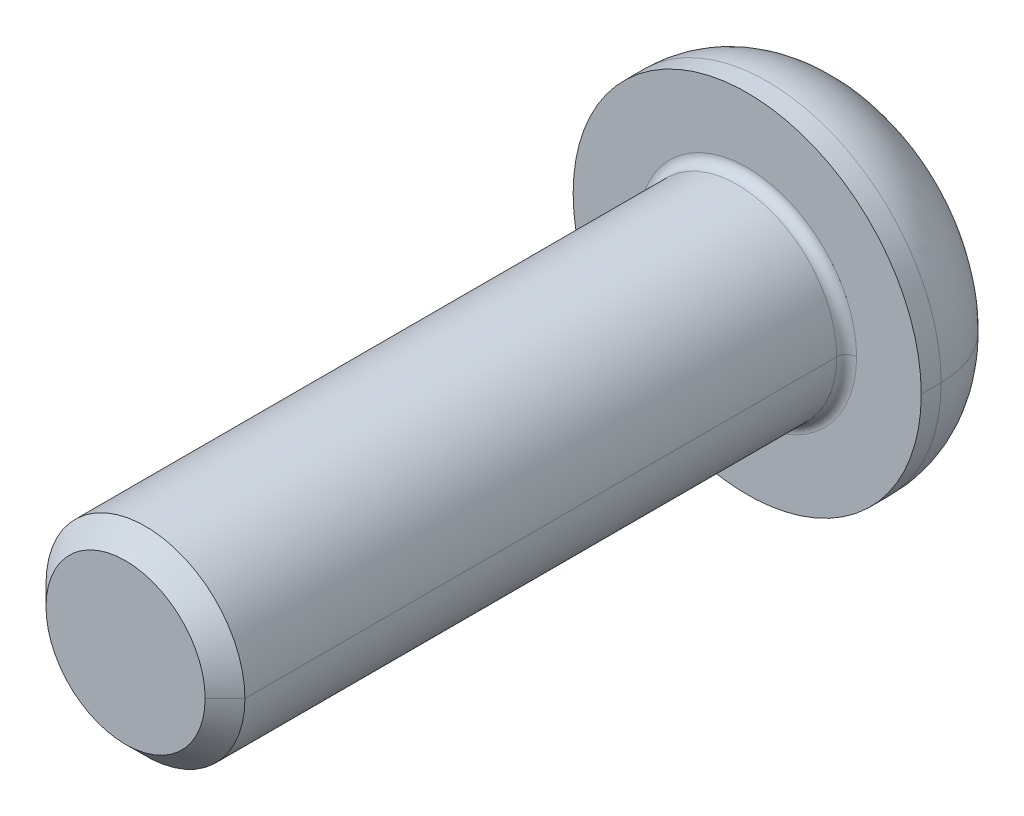
ISO-10303-21;
HEADER;
FILE_DESCRIPTION(('STEP AP214'),'2;1');
FILE_NAME('part.step','',(''),(''),'','','');
FILE_SCHEMA(('AUTOMOTIVE_DESIGN { 1 0 10303 214 1 1 1 1 }'));
ENDSEC;
DATA;
#1=APPLICATION_CONTEXT('core data for automotive mechanical design processes');
#2=APPLICATION_PROTOCOL_DEFINITION('international standard','automotive_design',2000,#1);
#3=PRODUCT_CONTEXT('',#1,'mechanical');
#4=PRODUCT('Part','Part','',(#3));
#5=PRODUCT_RELATED_PRODUCT_CATEGORY('part','',(#4));
#6=PRODUCT_DEFINITION_FORMATION('','',#4);
#7=PRODUCT_DEFINITION_CONTEXT('part definition',#1,'design');
#8=PRODUCT_DEFINITION('design','',#6,#7);
#9=PRODUCT_DEFINITION_SHAPE('','',#8);
#10=(LENGTH_UNIT() NAMED_UNIT(*) SI_UNIT(.MILLI.,.METRE.));
#11=(NAMED_UNIT(*) PLANE_ANGLE_UNIT() SI_UNIT($,.RADIAN.));
#12=(NAMED_UNIT(*) SI_UNIT($,.STERADIAN.) SOLID_ANGLE_UNIT());
#13=UNCERTAINTY_MEASURE_WITH_UNIT(LENGTH_MEASURE(1.E-05),#10,'distance_accuracy_value','');
#14=(GEOMETRIC_REPRESENTATION_CONTEXT(3) GLOBAL_UNCERTAINTY_ASSIGNED_CONTEXT((#13)) GLOBAL_UNIT_ASSIGNED_CONTEXT((#10,
#11,#12)) REPRESENTATION_CONTEXT('',''));
#15=CARTESIAN_POINT('',(0.,0.,0.));
#16=DIRECTION('',(0.,0.,1.));
#17=DIRECTION('',(1.,0.,0.));
#18=AXIS2_PLACEMENT_3D('',#15,#16,#17);
#19=CARTESIAN_POINT('',(0.,0.,0.4));
#20=DIRECTION('',(0.,0.,-1.));
#21=DIRECTION('',(-1.,0.,0.));
#22=AXIS2_PLACEMENT_3D('',#19,#20,#21);
#23=TOROIDAL_SURFACE('',#22,4.4,0.4);
#24=CARTESIAN_POINT('',(4.4,0.,0.4));
#25=DIRECTION('',(0.,1.,0.));
#26=DIRECTION('',(-1.,0.,0.));
#27=AXIS2_PLACEMENT_3D('',#24,#25,#26);
#28=CIRCLE('',#27,0.4);
#29=CARTESIAN_POINT('',(4.4,0.,0.));
#30=VERTEX_POINT('',#29);
#31=CARTESIAN_POINT('',(4.,0.,0.4));
#32=VERTEX_POINT('',#31);
#33=EDGE_CURVE('E247',#30,#32,#28,.T.);
#34=ORIENTED_EDGE('',*,*,#33,.F.);
#35=CARTESIAN_POINT('',(0.,0.,0.));
#36=DIRECTION('',(0.,0.,-1.));
#37=DIRECTION('',(-1.,0.,0.));
#38=AXIS2_PLACEMENT_3D('',#35,#36,#37);
#39=CIRCLE('',#38,4.4);
#40=CARTESIAN_POINT('',(-4.4,0.,0.));
#41=VERTEX_POINT('',#40);
#42=EDGE_CURVE('E144',#41,#30,#39,.T.);
#43=ORIENTED_EDGE('',*,*,#42,.F.);
#44=CARTESIAN_POINT('',(-4.4,0.,0.4));
#45=DIRECTION('',(0.,-1.,0.));
#46=DIRECTION('',(0.,0.,-1.));
#47=AXIS2_PLACEMENT_3D('',#44,#45,#46);
#48=CIRCLE('',#47,0.4);
#49=CARTESIAN_POINT('',(-4.,0.,0.4));
#50=VERTEX_POINT('',#49);
#51=EDGE_CURVE('E239',#41,#50,#48,.T.);
#52=ORIENTED_EDGE('',*,*,#51,.T.);
#53=CARTESIAN_POINT('',(0.,0.,0.4));
#54=DIRECTION('',(0.,0.,1.));
#55=DIRECTION('',(-1.,0.,0.));
#56=AXIS2_PLACEMENT_3D('',#53,#54,#55);
#57=CIRCLE('',#56,4.);
#58=EDGE_CURVE('E188',#32,#50,#57,.T.);
#59=ORIENTED_EDGE('',*,*,#58,.F.);
#60=EDGE_LOOP('',(#34,#43,#52,#59));
#61=FACE_BOUND('',#60,.T.);
#62=ADVANCED_FACE('F17',(#61),#23,.F.);
#63=CARTESIAN_POINT('',(0.,0.,25.));
#64=DIRECTION('',(0.,0.,-1.));
#65=DIRECTION('',(-1.,0.,0.));
#66=AXIS2_PLACEMENT_3D('',#63,#64,#65);
#67=CONICAL_SURFACE('',#66,3.2,0.785398163397446);
#68=DIRECTION('',(0.707106781186546,0.,-0.707106781186549));
#69=VECTOR('',#68,1.);
#70=CARTESIAN_POINT('',(3.2,0.,25.));
#71=LINE('',#70,#69);
#72=CARTESIAN_POINT('',(3.2,0.,25.));
#73=VERTEX_POINT('',#72);
#74=CARTESIAN_POINT('',(4.,0.,24.2));
#75=VERTEX_POINT('',#74);
#76=EDGE_CURVE('E215',#73,#75,#71,.T.);
#77=ORIENTED_EDGE('',*,*,#76,.F.);
#78=CARTESIAN_POINT('',(0.,0.,25.));
#79=DIRECTION('',(0.,0.,1.));
#80=DIRECTION('',(1.,0.,0.));
#81=AXIS2_PLACEMENT_3D('',#78,#79,#80);
#82=CIRCLE('',#81,3.2);
#83=CARTESIAN_POINT('',(-3.2,0.,25.));
#84=VERTEX_POINT('',#83);
#85=EDGE_CURVE('E176',#84,#73,#82,.T.);
#86=ORIENTED_EDGE('',*,*,#85,.F.);
#87=DIRECTION('',(-0.707106781186546,0.,-0.707106781186549));
#88=VECTOR('',#87,1.);
#89=CARTESIAN_POINT('',(-3.2,0.,25.));
#90=LINE('',#89,#88);
#91=CARTESIAN_POINT('',(-4.,0.,24.2));
#92=VERTEX_POINT('',#91);
#93=EDGE_CURVE('E206',#84,#92,#90,.T.);
#94=ORIENTED_EDGE('',*,*,#93,.T.);
#95=CARTESIAN_POINT('',(0.,0.,24.2));
#96=DIRECTION('',(0.,0.,-1.));
#97=DIRECTION('',(1.,0.,0.));
#98=AXIS2_PLACEMENT_3D('',#95,#96,#97);
#99=CIRCLE('',#98,4.);
#100=EDGE_CURVE('E180',#75,#92,#99,.T.);
#101=ORIENTED_EDGE('',*,*,#100,.F.);
#102=EDGE_LOOP('',(#77,#86,#94,#101));
#103=FACE_BOUND('',#102,.T.);
#104=ADVANCED_FACE('F546',(#103),#67,.T.);
#105=CARTESIAN_POINT('',(0.,0.,-0.8));
#106=DIRECTION('',(0.,0.,-1.));
#107=DIRECTION('',(-1.,0.,0.));
#108=AXIS2_PLACEMENT_3D('',#105,#106,#107);
#109=DEGENERATE_TOROIDAL_SURFACE('',#108,3.4,3.6,.T.);
#110=CARTESIAN_POINT('',(3.4,0.,-0.8));
#111=DIRECTION('',(0.,1.,0.));
#112=DIRECTION('',(-1.,0.,0.));
#113=AXIS2_PLACEMENT_3D('',#110,#111,#112);
#114=CIRCLE('',#113,3.6);
#115=CARTESIAN_POINT('',(7.,0.,-0.8));
#116=VERTEX_POINT('',#115);
#117=CARTESIAN_POINT('',(3.4,0.,-4.4));
#118=VERTEX_POINT('',#117);
#119=EDGE_CURVE('E219',#116,#118,#114,.T.);
#120=ORIENTED_EDGE('',*,*,#119,.F.);
#121=CARTESIAN_POINT('',(0.,0.,-0.8));
#122=DIRECTION('',(0.,0.,1.));
#123=DIRECTION('',(-1.,0.,0.));
#124=AXIS2_PLACEMENT_3D('',#121,#122,#123);
#125=CIRCLE('',#124,7.);
#126=CARTESIAN_POINT('',(-7.,0.,-0.8));
#127=VERTEX_POINT('',#126);
#128=EDGE_CURVE('E172',#127,#116,#125,.T.);
#129=ORIENTED_EDGE('',*,*,#128,.F.);
#130=CARTESIAN_POINT('',(-3.4,0.,-0.8));
#131=DIRECTION('',(0.,-1.,0.));
#132=DIRECTION('',(0.,0.,-1.));
#133=AXIS2_PLACEMENT_3D('',#130,#131,#132);
#134=CIRCLE('',#133,3.6);
#135=CARTESIAN_POINT('',(-3.4,0.,-4.4));
#136=VERTEX_POINT('',#135);
#137=EDGE_CURVE('E205',#127,#136,#134,.T.);
#138=ORIENTED_EDGE('',*,*,#137,.T.);
#139=CARTESIAN_POINT('',(0.,0.,-4.4));
#140=DIRECTION('',(0.,0.,-1.));
#141=DIRECTION('',(-1.,0.,0.));
#142=AXIS2_PLACEMENT_3D('',#139,#140,#141);
#143=CIRCLE('',#142,3.4);
#144=EDGE_CURVE('E164',#118,#136,#143,.T.);
#145=ORIENTED_EDGE('',*,*,#144,.F.);
#146=EDGE_LOOP('',(#120,#129,#138,#145));
#147=FACE_BOUND('',#146,.T.);
#148=ADVANCED_FACE('F538',(#147),#109,.T.);
#149=CARTESIAN_POINT('',(0.,0.,-1.8));
#150=DIRECTION('',(0.,0.,-1.));
#151=DIRECTION('',(0.,-1.,0.));
#152=AXIS2_PLACEMENT_3D('',#149,#150,#151);
#153=PLANE('',#152);
#154=DIRECTION('',(-1.,0.,0.));
#155=VECTOR('',#154,1.);
#156=CARTESIAN_POINT('',(1.44337567297406,-2.5,-1.8));
#157=LINE('',#156,#155);
#158=CARTESIAN_POINT('',(1.44337567297406,-2.5,-1.8));
#159=VERTEX_POINT('',#158);
#160=CARTESIAN_POINT('',(-1.44337567297406,-2.5,-1.8));
#161=VERTEX_POINT('',#160);
#162=EDGE_CURVE('E109',#159,#161,#157,.T.);
#163=ORIENTED_EDGE('',*,*,#162,.T.);
#164=DIRECTION('',(-0.5,0.866025403784439,0.));
#165=VECTOR('',#164,1.);
#166=CARTESIAN_POINT('',(-1.44337567297406,-2.5,-1.8));
#167=LINE('',#166,#165);
#168=CARTESIAN_POINT('',(-2.88675134594813,0.,-1.8));
#169=VERTEX_POINT('',#168);
#170=EDGE_CURVE('E11',#161,#169,#167,.T.);
#171=ORIENTED_EDGE('',*,*,#170,.T.);
#172=DIRECTION('',(0.5,0.866025403784439,0.));
#173=VECTOR('',#172,1.);
#174=CARTESIAN_POINT('',(-2.88675134594813,0.,-1.8));
#175=LINE('',#174,#173);
#176=CARTESIAN_POINT('',(-1.44337567297406,2.5,-1.8));
#177=VERTEX_POINT('',#176);
#178=EDGE_CURVE('E47',#169,#177,#175,.T.);
#179=ORIENTED_EDGE('',*,*,#178,.T.);
#180=DIRECTION('',(1.,0.,0.));
#181=VECTOR('',#180,1.);
#182=CARTESIAN_POINT('',(-1.44337567297406,2.5,-1.8));
#183=LINE('',#182,#181);
#184=CARTESIAN_POINT('',(1.44337567297406,2.5,-1.8));
#185=VERTEX_POINT('',#184);
#186=EDGE_CURVE('E80',#177,#185,#183,.T.);
#187=ORIENTED_EDGE('',*,*,#186,.T.);
#188=DIRECTION('',(0.5,-0.866025403784439,0.));
#189=VECTOR('',#188,1.);
#190=CARTESIAN_POINT('',(1.44337567297406,2.5,-1.8));
#191=LINE('',#190,#189);
#192=CARTESIAN_POINT('',(2.88675134594813,0.,-1.8));
#193=VERTEX_POINT('',#192);
#194=EDGE_CURVE('E73',#185,#193,#191,.T.);
#195=ORIENTED_EDGE('',*,*,#194,.T.);
#196=DIRECTION('',(-0.5,-0.866025403784439,0.));
#197=VECTOR('',#196,1.);
#198=CARTESIAN_POINT('',(2.88675134594813,0.,-1.8));
#199=LINE('',#198,#197);
#200=EDGE_CURVE('E77',#193,#159,#199,.T.);
#201=ORIENTED_EDGE('',*,*,#200,.T.);
#202=EDGE_LOOP('',(#163,#171,#179,#187,#195,#201));
#203=FACE_BOUND('',#202,.T.);
#204=ADVANCED_FACE('F75',(#203),#153,.T.);
#205=CARTESIAN_POINT('',(-1.44337567297406,-2.5,-1.8));
#206=DIRECTION('',(-0.866025403784439,-0.5,0.));
#207=DIRECTION('',(-0.5,0.866025403784439,0.));
#208=AXIS2_PLACEMENT_3D('',#205,#206,#207);
#209=PLANE('',#208);
#210=DIRECTION('',(-0.5,0.866025403784439,0.));
#211=VECTOR('',#210,1.);
#212=CARTESIAN_POINT('',(-1.44337567297406,-2.5,-4.4));
#213=LINE('',#212,#211);
#214=CARTESIAN_POINT('',(-1.44337567297407,-2.5,-4.4));
#215=VERTEX_POINT('',#214);
#216=CARTESIAN_POINT('',(-2.88675134594813,0.,-4.4));
#217=VERTEX_POINT('',#216);
#218=EDGE_CURVE('E136',#215,#217,#213,.T.);
#219=ORIENTED_EDGE('',*,*,#218,.T.);
#220=DIRECTION('',(0.,0.,-1.));
#221=VECTOR('',#220,1.);
#222=CARTESIAN_POINT('',(-2.88675134594813,0.,-1.8));
#223=LINE('',#222,#221);
#224=EDGE_CURVE('E25',#169,#217,#223,.T.);
#225=ORIENTED_EDGE('',*,*,#224,.F.);
#226=ORIENTED_EDGE('',*,*,#170,.F.);
#227=DIRECTION('',(0.,0.,-1.));
#228=VECTOR('',#227,1.);
#229=CARTESIAN_POINT('',(-1.44337567297406,-2.5,-1.8));
#230=LINE('',#229,#228);
#231=EDGE_CURVE('E112',#161,#215,#230,.T.);
#232=ORIENTED_EDGE('',*,*,#231,.T.);
#233=EDGE_LOOP('',(#219,#225,#226,#232));
#234=FACE_BOUND('',#233,.T.);
#235=ADVANCED_FACE('F137',(#234),#209,.F.);
#236=CARTESIAN_POINT('',(-2.88675134594813,0.,-1.8));
#237=DIRECTION('',(-0.866025403784439,0.5,0.));
#238=DIRECTION('',(0.,0.,1.));
#239=AXIS2_PLACEMENT_3D('',#236,#237,#238);
#240=PLANE('',#239);
#241=DIRECTION('',(0.5,0.866025403784439,0.));
#242=VECTOR('',#241,1.);
#243=CARTESIAN_POINT('',(-2.88675134594813,0.,-4.4));
#244=LINE('',#243,#242);
#245=CARTESIAN_POINT('',(-1.44337567297406,2.5,-4.4));
#246=VERTEX_POINT('',#245);
#247=EDGE_CURVE('E131',#217,#246,#244,.T.);
#248=ORIENTED_EDGE('',*,*,#247,.T.);
#249=DIRECTION('',(0.,0.,-1.));
#250=VECTOR('',#249,1.);
#251=CARTESIAN_POINT('',(-1.44337567297406,2.5,-1.8));
#252=LINE('',#251,#250);
#253=EDGE_CURVE('E119',#177,#246,#252,.T.);
#254=ORIENTED_EDGE('',*,*,#253,.F.);
#255=ORIENTED_EDGE('',*,*,#178,.F.);
#256=ORIENTED_EDGE('',*,*,#224,.T.);
#257=EDGE_LOOP('',(#248,#254,#255,#256));
#258=FACE_BOUND('',#257,.T.);
#259=ADVANCED_FACE('F129',(#258),#240,.F.);
#260=CARTESIAN_POINT('',(-1.44337567297406,2.5,-1.8));
#261=DIRECTION('',(0.,1.,0.));
#262=DIRECTION('',(1.,0.,0.));
#263=AXIS2_PLACEMENT_3D('',#260,#261,#262);
#264=PLANE('',#263);
#265=DIRECTION('',(1.,0.,0.));
#266=VECTOR('',#265,1.);
#267=CARTESIAN_POINT('',(-1.44337567297406,2.5,-4.4));
#268=LINE('',#267,#266);
#269=CARTESIAN_POINT('',(1.44337567297406,2.5,-4.4));
#270=VERTEX_POINT('',#269);
#271=EDGE_CURVE('E149',#246,#270,#268,.T.);
#272=ORIENTED_EDGE('',*,*,#271,.T.);
#273=DIRECTION('',(0.,0.,-1.));
#274=VECTOR('',#273,1.);
#275=CARTESIAN_POINT('',(1.44337567297406,2.5,-1.8));
#276=LINE('',#275,#274);
#277=EDGE_CURVE('E85',#185,#270,#276,.T.);
#278=ORIENTED_EDGE('',*,*,#277,.F.);
#279=ORIENTED_EDGE('',*,*,#186,.F.);
#280=ORIENTED_EDGE('',*,*,#253,.T.);
#281=EDGE_LOOP('',(#272,#278,#279,#280));
#282=FACE_BOUND('',#281,.T.);
#283=ADVANCED_FACE('F321',(#282),#264,.F.);
#284=CARTESIAN_POINT('',(1.44337567297406,2.5,-1.8));
#285=DIRECTION('',(0.866025403784439,0.5,0.));
#286=DIRECTION('',(0.,0.,-1.));
#287=AXIS2_PLACEMENT_3D('',#284,#285,#286);
#288=PLANE('',#287);
#289=DIRECTION('',(0.5,-0.866025403784439,0.));
#290=VECTOR('',#289,1.);
#291=CARTESIAN_POINT('',(1.44337567297406,2.5,-4.4));
#292=LINE('',#291,#290);
#293=CARTESIAN_POINT('',(2.88675134594813,0.,-4.4));
#294=VERTEX_POINT('',#293);
#295=EDGE_CURVE('E93',#270,#294,#292,.T.);
#296=ORIENTED_EDGE('',*,*,#295,.T.);
#297=DIRECTION('',(0.,0.,-1.));
#298=VECTOR('',#297,1.);
#299=CARTESIAN_POINT('',(2.88675134594813,0.,-1.8));
#300=LINE('',#299,#298);
#301=EDGE_CURVE('E86',#193,#294,#300,.T.);
#302=ORIENTED_EDGE('',*,*,#301,.F.);
#303=ORIENTED_EDGE('',*,*,#194,.F.);
#304=ORIENTED_EDGE('',*,*,#277,.T.);
#305=EDGE_LOOP('',(#296,#302,#303,#304));
#306=FACE_BOUND('',#305,.T.);
#307=ADVANCED_FACE('F90',(#306),#288,.F.);
#308=CARTESIAN_POINT('',(2.88675134594813,0.,-1.8));
#309=DIRECTION('',(0.866025403784439,-0.5,0.));
#310=DIRECTION('',(0.,0.,-1.));
#311=AXIS2_PLACEMENT_3D('',#308,#309,#310);
#312=PLANE('',#311);
#313=DIRECTION('',(-0.5,-0.866025403784439,0.));
#314=VECTOR('',#313,1.);
#315=CARTESIAN_POINT('',(2.88675134594813,0.,-4.4));
#316=LINE('',#315,#314);
#317=CARTESIAN_POINT('',(1.44337567297406,-2.5,-4.4));
#318=VERTEX_POINT('',#317);
#319=EDGE_CURVE('E157',#294,#318,#316,.T.);
#320=ORIENTED_EDGE('',*,*,#319,.T.);
#321=DIRECTION('',(0.,0.,-1.));
#322=VECTOR('',#321,1.);
#323=CARTESIAN_POINT('',(1.44337567297406,-2.5,-1.8));
#324=LINE('',#323,#322);
#325=EDGE_CURVE('E101',#159,#318,#324,.T.);
#326=ORIENTED_EDGE('',*,*,#325,.F.);
#327=ORIENTED_EDGE('',*,*,#200,.F.);
#328=ORIENTED_EDGE('',*,*,#301,.T.);
#329=EDGE_LOOP('',(#320,#326,#327,#328));
#330=FACE_BOUND('',#329,.T.);
#331=ADVANCED_FACE('F99',(#330),#312,.F.);
#332=CARTESIAN_POINT('',(1.44337567297406,-2.5,-1.8));
#333=DIRECTION('',(0.,-1.,0.));
#334=DIRECTION('',(-1.,0.,0.));
#335=AXIS2_PLACEMENT_3D('',#332,#333,#334);
#336=PLANE('',#335);
#337=DIRECTION('',(-1.,0.,0.));
#338=VECTOR('',#337,1.);
#339=CARTESIAN_POINT('',(1.44337567297406,-2.5,-4.4));
#340=LINE('',#339,#338);
#341=EDGE_CURVE('E161',#318,#215,#340,.T.);
#342=ORIENTED_EDGE('',*,*,#341,.T.);
#343=ORIENTED_EDGE('',*,*,#231,.F.);
#344=ORIENTED_EDGE('',*,*,#162,.F.);
#345=ORIENTED_EDGE('',*,*,#325,.T.);
#346=EDGE_LOOP('',(#342,#343,#344,#345));
#347=FACE_BOUND('',#346,.T.);
#348=ADVANCED_FACE('F323',(#347),#336,.F.);
#349=CARTESIAN_POINT('',(0.,0.,0.));
#350=DIRECTION('',(0.,0.,-1.));
#351=DIRECTION('',(0.,-1.,0.));
#352=AXIS2_PLACEMENT_3D('',#349,#350,#351);
#353=PLANE('',#352);
#354=ORIENTED_EDGE('',*,*,#42,.T.);
#355=CARTESIAN_POINT('',(0.,0.,0.));
#356=DIRECTION('',(0.,0.,-1.));
#357=DIRECTION('',(-1.,0.,0.));
#358=AXIS2_PLACEMENT_3D('',#355,#356,#357);
#359=CIRCLE('',#358,4.4);
#360=EDGE_CURVE('E251',#30,#41,#359,.T.);
#361=ORIENTED_EDGE('',*,*,#360,.T.);
#362=EDGE_LOOP('',(#354,#361));
#363=FACE_BOUND('',#362,.T.);
#364=CARTESIAN_POINT('',(0.,0.,0.));
#365=DIRECTION('',(0.,0.,-1.));
#366=DIRECTION('',(-1.,0.,0.));
#367=AXIS2_PLACEMENT_3D('',#364,#365,#366);
#368=CIRCLE('',#367,7.);
#369=CARTESIAN_POINT('',(7.,0.,0.));
#370=VERTEX_POINT('',#369);
#371=CARTESIAN_POINT('',(-7.,0.,0.));
#372=VERTEX_POINT('',#371);
#373=EDGE_CURVE('E168',#370,#372,#368,.T.);
#374=ORIENTED_EDGE('',*,*,#373,.F.);
#375=CARTESIAN_POINT('',(0.,0.,0.));
#376=DIRECTION('',(0.,0.,-1.));
#377=DIRECTION('',(-1.,0.,0.));
#378=AXIS2_PLACEMENT_3D('',#375,#376,#377);
#379=CIRCLE('',#378,7.);
#380=EDGE_CURVE('E197',#372,#370,#379,.T.);
#381=ORIENTED_EDGE('',*,*,#380,.F.);
#382=EDGE_LOOP('',(#374,#381));
#383=FACE_BOUND('',#382,.T.);
#384=ADVANCED_FACE('F478',(#363,#383),#353,.F.);
#385=CARTESIAN_POINT('',(0.,0.,-4.4));
#386=DIRECTION('',(0.,0.,-1.));
#387=DIRECTION('',(0.,-1.,0.));
#388=AXIS2_PLACEMENT_3D('',#385,#386,#387);
#389=PLANE('',#388);
#390=ORIENTED_EDGE('',*,*,#341,.F.);
#391=ORIENTED_EDGE('',*,*,#319,.F.);
#392=ORIENTED_EDGE('',*,*,#295,.F.);
#393=ORIENTED_EDGE('',*,*,#271,.F.);
#394=ORIENTED_EDGE('',*,*,#247,.F.);
#395=ORIENTED_EDGE('',*,*,#218,.F.);
#396=EDGE_LOOP('',(#390,#391,#392,#393,#394,#395));
#397=FACE_BOUND('',#396,.T.);
#398=CARTESIAN_POINT('',(0.,0.,-4.4));
#399=DIRECTION('',(0.,0.,-1.));
#400=DIRECTION('',(-1.,0.,0.));
#401=AXIS2_PLACEMENT_3D('',#398,#399,#400);
#402=CIRCLE('',#401,3.4);
#403=EDGE_CURVE('E225',#136,#118,#402,.T.);
#404=ORIENTED_EDGE('',*,*,#403,.T.);
#405=ORIENTED_EDGE('',*,*,#144,.T.);
#406=EDGE_LOOP('',(#404,#405));
#407=FACE_BOUND('',#406,.T.);
#408=ADVANCED_FACE('F146',(#397,#407),#389,.T.);
#409=CARTESIAN_POINT('',(0.,0.,-4.4));
#410=DIRECTION('',(0.,0.,1.));
#411=DIRECTION('',(1.,0.,0.));
#412=AXIS2_PLACEMENT_3D('',#409,#410,#411);
#413=CYLINDRICAL_SURFACE('',#412,7.);
#414=DIRECTION('',(0.,0.,1.));
#415=VECTOR('',#414,1.);
#416=CARTESIAN_POINT('',(-7.,0.,-4.4));
#417=LINE('',#416,#415);
#418=EDGE_CURVE('E201',#127,#372,#417,.T.);
#419=ORIENTED_EDGE('',*,*,#418,.F.);
#420=ORIENTED_EDGE('',*,*,#128,.T.);
#421=DIRECTION('',(0.,0.,1.));
#422=VECTOR('',#421,1.);
#423=CARTESIAN_POINT('',(7.,0.,-4.4));
#424=LINE('',#423,#422);
#425=EDGE_CURVE('E193',#116,#370,#424,.T.);
#426=ORIENTED_EDGE('',*,*,#425,.T.);
#427=ORIENTED_EDGE('',*,*,#373,.T.);
#428=EDGE_LOOP('',(#419,#420,#426,#427));
#429=FACE_BOUND('',#428,.T.);
#430=ADVANCED_FACE('F486',(#429),#413,.T.);
#431=CARTESIAN_POINT('',(0.,0.,25.));
#432=DIRECTION('',(0.,0.,1.));
#433=DIRECTION('',(1.,0.,0.));
#434=AXIS2_PLACEMENT_3D('',#431,#432,#433);
#435=PLANE('',#434);
#436=ORIENTED_EDGE('',*,*,#85,.T.);
#437=CARTESIAN_POINT('',(0.,0.,25.));
#438=DIRECTION('',(0.,0.,1.));
#439=DIRECTION('',(1.,0.,0.));
#440=AXIS2_PLACEMENT_3D('',#437,#438,#439);
#441=CIRCLE('',#440,3.2);
#442=EDGE_CURVE('E235',#73,#84,#441,.T.);
#443=ORIENTED_EDGE('',*,*,#442,.T.);
#444=EDGE_LOOP('',(#436,#443));
#445=FACE_BOUND('',#444,.T.);
#446=ADVANCED_FACE('F265',(#445),#435,.T.);
#447=CARTESIAN_POINT('',(0.,0.,25.));
#448=DIRECTION('',(0.,0.,-1.));
#449=DIRECTION('',(-1.,0.,0.));
#450=AXIS2_PLACEMENT_3D('',#447,#448,#449);
#451=CYLINDRICAL_SURFACE('',#450,4.);
#452=DIRECTION('',(0.,0.,-1.));
#453=VECTOR('',#452,1.);
#454=CARTESIAN_POINT('',(4.,0.,25.));
#455=LINE('',#454,#453);
#456=EDGE_CURVE('E192',#75,#32,#455,.T.);
#457=ORIENTED_EDGE('',*,*,#456,.F.);
#458=ORIENTED_EDGE('',*,*,#100,.T.);
#459=DIRECTION('',(0.,0.,-1.));
#460=VECTOR('',#459,1.);
#461=CARTESIAN_POINT('',(-4.,0.,25.));
#462=LINE('',#461,#460);
#463=EDGE_CURVE('E184',#92,#50,#462,.T.);
#464=ORIENTED_EDGE('',*,*,#463,.T.);
#465=CARTESIAN_POINT('',(0.,0.,0.4));
#466=DIRECTION('',(0.,0.,1.));
#467=DIRECTION('',(-1.,0.,0.));
#468=AXIS2_PLACEMENT_3D('',#465,#466,#467);
#469=CIRCLE('',#468,4.);
#470=EDGE_CURVE('E243',#50,#32,#469,.T.);
#471=ORIENTED_EDGE('',*,*,#470,.T.);
#472=EDGE_LOOP('',(#457,#458,#464,#471));
#473=FACE_BOUND('',#472,.T.);
#474=ADVANCED_FACE('F435',(#473),#451,.T.);
#475=CARTESIAN_POINT('',(0.,0.,25.));
#476=DIRECTION('',(0.,0.,-1.));
#477=DIRECTION('',(-1.,0.,0.));
#478=AXIS2_PLACEMENT_3D('',#475,#476,#477);
#479=CYLINDRICAL_SURFACE('',#478,4.);
#480=CARTESIAN_POINT('',(0.,0.,24.2));
#481=DIRECTION('',(0.,0.,-1.));
#482=DIRECTION('',(1.,0.,0.));
#483=AXIS2_PLACEMENT_3D('',#480,#481,#482);
#484=CIRCLE('',#483,4.);
#485=EDGE_CURVE('E211',#92,#75,#484,.T.);
#486=ORIENTED_EDGE('',*,*,#485,.T.);
#487=ORIENTED_EDGE('',*,*,#456,.T.);
#488=ORIENTED_EDGE('',*,*,#58,.T.);
#489=ORIENTED_EDGE('',*,*,#463,.F.);
#490=EDGE_LOOP('',(#486,#487,#488,#489));
#491=FACE_BOUND('',#490,.T.);
#492=ADVANCED_FACE('F440',(#491),#479,.T.);
#493=CARTESIAN_POINT('',(0.,0.,-4.4));
#494=DIRECTION('',(0.,0.,1.));
#495=DIRECTION('',(1.,0.,0.));
#496=AXIS2_PLACEMENT_3D('',#493,#494,#495);
#497=CYLINDRICAL_SURFACE('',#496,7.);
#498=CARTESIAN_POINT('',(0.,0.,-0.8));
#499=DIRECTION('',(0.,0.,1.));
#500=DIRECTION('',(-1.,0.,0.));
#501=AXIS2_PLACEMENT_3D('',#498,#499,#500);
#502=CIRCLE('',#501,7.);
#503=EDGE_CURVE('E210',#116,#127,#502,.T.);
#504=ORIENTED_EDGE('',*,*,#503,.T.);
#505=ORIENTED_EDGE('',*,*,#418,.T.);
#506=ORIENTED_EDGE('',*,*,#380,.T.);
#507=ORIENTED_EDGE('',*,*,#425,.F.);
#508=EDGE_LOOP('',(#504,#505,#506,#507));
#509=FACE_BOUND('',#508,.T.);
#510=ADVANCED_FACE('F429',(#509),#497,.T.);
#511=CARTESIAN_POINT('',(0.,0.,-0.8));
#512=DIRECTION('',(0.,0.,-1.));
#513=DIRECTION('',(-1.,0.,0.));
#514=AXIS2_PLACEMENT_3D('',#511,#512,#513);
#515=DEGENERATE_TOROIDAL_SURFACE('',#514,3.4,3.6,.T.);
#516=ORIENTED_EDGE('',*,*,#503,.F.);
#517=ORIENTED_EDGE('',*,*,#119,.T.);
#518=ORIENTED_EDGE('',*,*,#403,.F.);
#519=ORIENTED_EDGE('',*,*,#137,.F.);
#520=EDGE_LOOP('',(#516,#517,#518,#519));
#521=FACE_BOUND('',#520,.T.);
#522=ADVANCED_FACE('F421',(#521),#515,.T.);
#523=CARTESIAN_POINT('',(0.,0.,25.));
#524=DIRECTION('',(0.,0.,-1.));
#525=DIRECTION('',(-1.,0.,0.));
#526=AXIS2_PLACEMENT_3D('',#523,#524,#525);
#527=CONICAL_SURFACE('',#526,3.2,0.785398163397446);
#528=ORIENTED_EDGE('',*,*,#442,.F.);
#529=ORIENTED_EDGE('',*,*,#76,.T.);
#530=ORIENTED_EDGE('',*,*,#485,.F.);
#531=ORIENTED_EDGE('',*,*,#93,.F.);
#532=EDGE_LOOP('',(#528,#529,#530,#531));
#533=FACE_BOUND('',#532,.T.);
#534=ADVANCED_FACE('F274',(#533),#527,.T.);
#535=CARTESIAN_POINT('',(0.,0.,0.4));
#536=DIRECTION('',(0.,0.,-1.));
#537=DIRECTION('',(-1.,0.,0.));
#538=AXIS2_PLACEMENT_3D('',#535,#536,#537);
#539=TOROIDAL_SURFACE('',#538,4.4,0.4);
#540=ORIENTED_EDGE('',*,*,#360,.F.);
#541=ORIENTED_EDGE('',*,*,#33,.T.);
#542=ORIENTED_EDGE('',*,*,#470,.F.);
#543=ORIENTED_EDGE('',*,*,#51,.F.);
#544=EDGE_LOOP('',(#540,#541,#542,#543));
#545=FACE_BOUND('',#544,.T.);
#546=ADVANCED_FACE('F409',(#545),#539,.F.);
#547=CLOSED_SHELL('',(#62,#104,#148,#204,#235,#259,#283,#307,#331,#348,#384,#408,#430,#446,#474,
#492,#510,#522,#534,#546));
#548=MANIFOLD_SOLID_BREP('B1',#547);
#549=ADVANCED_BREP_SHAPE_REPRESENTATION('',(#18,#548),#14);
#550=SHAPE_DEFINITION_REPRESENTATION(#9,#549);
ENDSEC;
END-ISO-10303-21;
